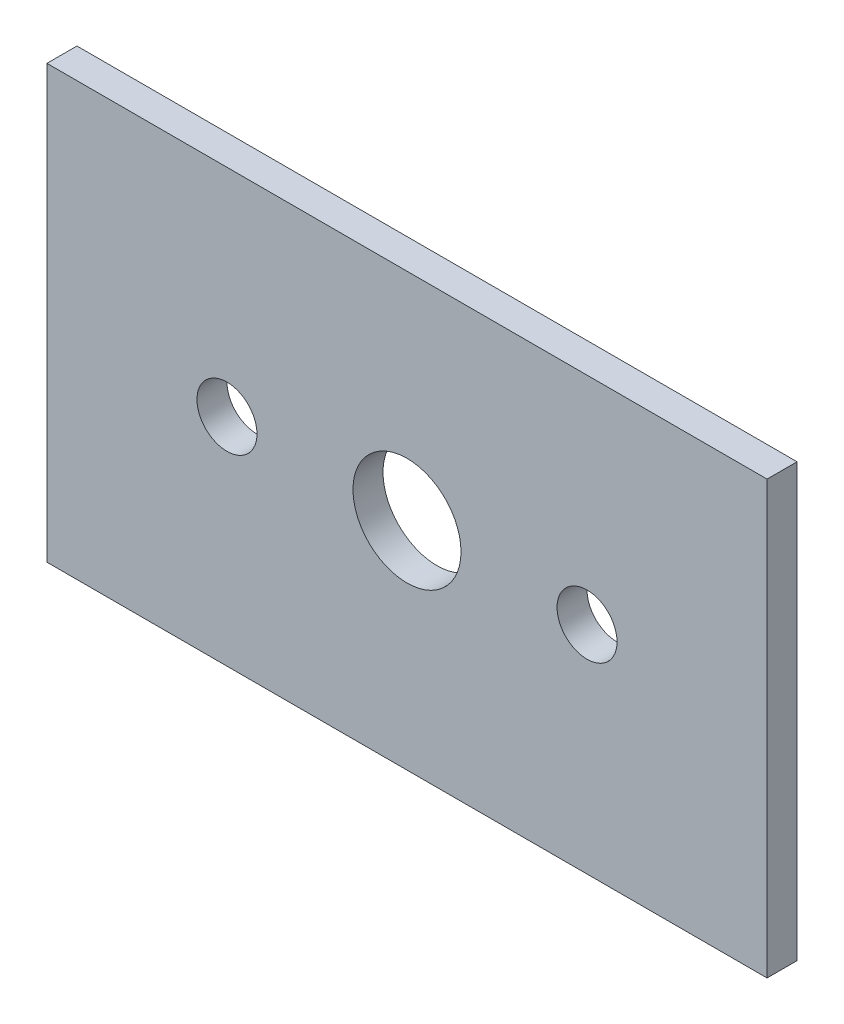
ISO-10303-21;
HEADER;
FILE_DESCRIPTION(('STEP AP214'),'2;1');
FILE_NAME('part.step','',(''),(''),'','','');
FILE_SCHEMA(('AUTOMOTIVE_DESIGN { 1 0 10303 214 1 1 1 1 }'));
ENDSEC;
DATA;
#1=APPLICATION_CONTEXT('core data for automotive mechanical design processes');
#2=APPLICATION_PROTOCOL_DEFINITION('international standard','automotive_design',2000,#1);
#3=PRODUCT_CONTEXT('',#1,'mechanical');
#4=PRODUCT('Part','Part','',(#3));
#5=PRODUCT_RELATED_PRODUCT_CATEGORY('part','',(#4));
#6=PRODUCT_DEFINITION_FORMATION('','',#4);
#7=PRODUCT_DEFINITION_CONTEXT('part definition',#1,'design');
#8=PRODUCT_DEFINITION('design','',#6,#7);
#9=PRODUCT_DEFINITION_SHAPE('','',#8);
#10=(LENGTH_UNIT() NAMED_UNIT(*) SI_UNIT(.MILLI.,.METRE.));
#11=(NAMED_UNIT(*) PLANE_ANGLE_UNIT() SI_UNIT($,.RADIAN.));
#12=(NAMED_UNIT(*) SI_UNIT($,.STERADIAN.) SOLID_ANGLE_UNIT());
#13=UNCERTAINTY_MEASURE_WITH_UNIT(LENGTH_MEASURE(1.E-05),#10,'distance_accuracy_value','');
#14=(GEOMETRIC_REPRESENTATION_CONTEXT(3) GLOBAL_UNCERTAINTY_ASSIGNED_CONTEXT((#13)) GLOBAL_UNIT_ASSIGNED_CONTEXT((#10,
#11,#12)) REPRESENTATION_CONTEXT('',''));
#15=CARTESIAN_POINT('',(0.,0.,0.));
#16=DIRECTION('',(0.,0.,1.));
#17=DIRECTION('',(1.,0.,0.));
#18=AXIS2_PLACEMENT_3D('',#15,#16,#17);
#19=CARTESIAN_POINT('',(0.,0.,6.35));
#20=DIRECTION('',(-1.,0.,0.));
#21=DIRECTION('',(0.,0.,1.));
#22=AXIS2_PLACEMENT_3D('',#19,#20,#21);
#23=PLANE('',#22);
#24=DIRECTION('',(0.,1.,0.));
#25=VECTOR('',#24,1.);
#26=CARTESIAN_POINT('',(0.,0.,0.));
#27=LINE('',#26,#25);
#28=CARTESIAN_POINT('',(0.,0.,0.));
#29=VERTEX_POINT('',#28);
#30=CARTESIAN_POINT('',(0.,91.44,0.));
#31=VERTEX_POINT('',#30);
#32=EDGE_CURVE('E101',#29,#31,#27,.T.);
#33=ORIENTED_EDGE('',*,*,#32,.F.);
#34=DIRECTION('',(0.,0.,-1.));
#35=VECTOR('',#34,1.);
#36=CARTESIAN_POINT('',(0.,0.,6.35));
#37=LINE('',#36,#35);
#38=CARTESIAN_POINT('',(0.,0.,6.35));
#39=VERTEX_POINT('',#38);
#40=EDGE_CURVE('E11',#39,#29,#37,.T.);
#41=ORIENTED_EDGE('',*,*,#40,.F.);
#42=DIRECTION('',(0.,1.,0.));
#43=VECTOR('',#42,1.);
#44=CARTESIAN_POINT('',(0.,0.,6.35));
#45=LINE('',#44,#43);
#46=CARTESIAN_POINT('',(0.,91.44,6.35));
#47=VERTEX_POINT('',#46);
#48=EDGE_CURVE('E95',#39,#47,#45,.T.);
#49=ORIENTED_EDGE('',*,*,#48,.T.);
#50=DIRECTION('',(0.,0.,-1.));
#51=VECTOR('',#50,1.);
#52=CARTESIAN_POINT('',(0.,91.44,6.35));
#53=LINE('',#52,#51);
#54=EDGE_CURVE('E38',#47,#31,#53,.T.);
#55=ORIENTED_EDGE('',*,*,#54,.T.);
#56=EDGE_LOOP('',(#33,#41,#49,#55));
#57=FACE_BOUND('',#56,.T.);
#58=ADVANCED_FACE('F35',(#57),#23,.T.);
#59=CARTESIAN_POINT('',(0.,0.,6.35));
#60=DIRECTION('',(0.,1.,0.));
#61=DIRECTION('',(0.,0.,1.));
#62=AXIS2_PLACEMENT_3D('',#59,#60,#61);
#63=PLANE('',#62);
#64=DIRECTION('',(1.,0.,0.));
#65=VECTOR('',#64,1.);
#66=CARTESIAN_POINT('',(0.,0.,0.));
#67=LINE('',#66,#65);
#68=CARTESIAN_POINT('',(152.4,0.,0.));
#69=VERTEX_POINT('',#68);
#70=EDGE_CURVE('E68',#29,#69,#67,.T.);
#71=ORIENTED_EDGE('',*,*,#70,.T.);
#72=DIRECTION('',(0.,0.,-1.));
#73=VECTOR('',#72,1.);
#74=CARTESIAN_POINT('',(152.4,0.,6.35));
#75=LINE('',#74,#73);
#76=CARTESIAN_POINT('',(152.4,0.,6.35));
#77=VERTEX_POINT('',#76);
#78=EDGE_CURVE('E44',#77,#69,#75,.T.);
#79=ORIENTED_EDGE('',*,*,#78,.F.);
#80=DIRECTION('',(1.,0.,0.));
#81=VECTOR('',#80,1.);
#82=CARTESIAN_POINT('',(0.,0.,6.35));
#83=LINE('',#82,#81);
#84=EDGE_CURVE('E85',#39,#77,#83,.T.);
#85=ORIENTED_EDGE('',*,*,#84,.F.);
#86=ORIENTED_EDGE('',*,*,#40,.T.);
#87=EDGE_LOOP('',(#71,#79,#85,#86));
#88=FACE_BOUND('',#87,.T.);
#89=ADVANCED_FACE('F112',(#88),#63,.F.);
#90=CARTESIAN_POINT('',(152.4,0.,6.35));
#91=DIRECTION('',(-1.,0.,0.));
#92=DIRECTION('',(0.,0.,1.));
#93=AXIS2_PLACEMENT_3D('',#90,#91,#92);
#94=PLANE('',#93);
#95=DIRECTION('',(0.,1.,0.));
#96=VECTOR('',#95,1.);
#97=CARTESIAN_POINT('',(152.4,0.,0.));
#98=LINE('',#97,#96);
#99=CARTESIAN_POINT('',(152.4,91.44,0.));
#100=VERTEX_POINT('',#99);
#101=EDGE_CURVE('E92',#69,#100,#98,.T.);
#102=ORIENTED_EDGE('',*,*,#101,.T.);
#103=DIRECTION('',(0.,0.,-1.));
#104=VECTOR('',#103,1.);
#105=CARTESIAN_POINT('',(152.4,91.44,6.35));
#106=LINE('',#105,#104);
#107=CARTESIAN_POINT('',(152.4,91.44,6.35));
#108=VERTEX_POINT('',#107);
#109=EDGE_CURVE('E89',#108,#100,#106,.T.);
#110=ORIENTED_EDGE('',*,*,#109,.F.);
#111=DIRECTION('',(0.,1.,0.));
#112=VECTOR('',#111,1.);
#113=CARTESIAN_POINT('',(152.4,0.,6.35));
#114=LINE('',#113,#112);
#115=EDGE_CURVE('E80',#77,#108,#114,.T.);
#116=ORIENTED_EDGE('',*,*,#115,.F.);
#117=ORIENTED_EDGE('',*,*,#78,.T.);
#118=EDGE_LOOP('',(#102,#110,#116,#117));
#119=FACE_BOUND('',#118,.T.);
#120=ADVANCED_FACE('F90',(#119),#94,.F.);
#121=CARTESIAN_POINT('',(0.,91.44,6.35));
#122=DIRECTION('',(0.,1.,0.));
#123=DIRECTION('',(0.,0.,1.));
#124=AXIS2_PLACEMENT_3D('',#121,#122,#123);
#125=PLANE('',#124);
#126=DIRECTION('',(1.,0.,0.));
#127=VECTOR('',#126,1.);
#128=CARTESIAN_POINT('',(0.,91.44,0.));
#129=LINE('',#128,#127);
#130=EDGE_CURVE('E104',#31,#100,#129,.T.);
#131=ORIENTED_EDGE('',*,*,#130,.F.);
#132=ORIENTED_EDGE('',*,*,#54,.F.);
#133=DIRECTION('',(1.,0.,0.));
#134=VECTOR('',#133,1.);
#135=CARTESIAN_POINT('',(0.,91.44,6.35));
#136=LINE('',#135,#134);
#137=EDGE_CURVE('E84',#47,#108,#136,.T.);
#138=ORIENTED_EDGE('',*,*,#137,.T.);
#139=ORIENTED_EDGE('',*,*,#109,.T.);
#140=EDGE_LOOP('',(#131,#132,#138,#139));
#141=FACE_BOUND('',#140,.T.);
#142=ADVANCED_FACE('F94',(#141),#125,.T.);
#143=CARTESIAN_POINT('',(0.,0.,6.35));
#144=DIRECTION('',(0.,0.,-1.));
#145=DIRECTION('',(-1.,0.,0.));
#146=AXIS2_PLACEMENT_3D('',#143,#144,#145);
#147=PLANE('',#146);
#148=CARTESIAN_POINT('',(38.1,45.72,6.35));
#149=DIRECTION('',(0.,0.,1.));
#150=DIRECTION('',(1.,0.,0.));
#151=AXIS2_PLACEMENT_3D('',#148,#149,#150);
#152=CIRCLE('',#151,6.35);
#153=CARTESIAN_POINT('',(44.45,45.72,6.35));
#154=VERTEX_POINT('',#153);
#155=EDGE_CURVE('E160',#154,#154,#152,.T.);
#156=ORIENTED_EDGE('',*,*,#155,.F.);
#157=EDGE_LOOP('',(#156));
#158=FACE_BOUND('',#157,.T.);
#159=CARTESIAN_POINT('',(114.3,45.72,6.35));
#160=DIRECTION('',(0.,0.,1.));
#161=DIRECTION('',(1.,0.,0.));
#162=AXIS2_PLACEMENT_3D('',#159,#160,#161);
#163=CIRCLE('',#162,6.35000000000001);
#164=CARTESIAN_POINT('',(120.65,45.72,6.35));
#165=VERTEX_POINT('',#164);
#166=EDGE_CURVE('E154',#165,#165,#163,.T.);
#167=ORIENTED_EDGE('',*,*,#166,.F.);
#168=EDGE_LOOP('',(#167));
#169=FACE_BOUND('',#168,.T.);
#170=CARTESIAN_POINT('',(76.2,45.72,6.35));
#171=DIRECTION('',(0.,0.,1.));
#172=DIRECTION('',(1.,0.,0.));
#173=AXIS2_PLACEMENT_3D('',#170,#171,#172);
#174=CIRCLE('',#173,11.43);
#175=CARTESIAN_POINT('',(87.63,45.72,6.35));
#176=VERTEX_POINT('',#175);
#177=EDGE_CURVE('E157',#176,#176,#174,.T.);
#178=ORIENTED_EDGE('',*,*,#177,.F.);
#179=EDGE_LOOP('',(#178));
#180=FACE_BOUND('',#179,.T.);
#181=ORIENTED_EDGE('',*,*,#48,.F.);
#182=ORIENTED_EDGE('',*,*,#84,.T.);
#183=ORIENTED_EDGE('',*,*,#115,.T.);
#184=ORIENTED_EDGE('',*,*,#137,.F.);
#185=EDGE_LOOP('',(#181,#182,#183,#184));
#186=FACE_BOUND('',#185,.T.);
#187=ADVANCED_FACE('F83',(#158,#169,#180,#186),#147,.F.);
#188=CARTESIAN_POINT('',(0.,0.,0.));
#189=DIRECTION('',(0.,0.,-1.));
#190=DIRECTION('',(-1.,0.,0.));
#191=AXIS2_PLACEMENT_3D('',#188,#189,#190);
#192=PLANE('',#191);
#193=CARTESIAN_POINT('',(38.1,45.72,0.));
#194=DIRECTION('',(0.,0.,1.));
#195=DIRECTION('',(1.,0.,0.));
#196=AXIS2_PLACEMENT_3D('',#193,#194,#195);
#197=CIRCLE('',#196,6.35);
#198=CARTESIAN_POINT('',(44.45,45.72,0.));
#199=VERTEX_POINT('',#198);
#200=EDGE_CURVE('E155',#199,#199,#197,.T.);
#201=ORIENTED_EDGE('',*,*,#200,.T.);
#202=EDGE_LOOP('',(#201));
#203=FACE_BOUND('',#202,.T.);
#204=CARTESIAN_POINT('',(114.3,45.72,0.));
#205=DIRECTION('',(0.,0.,1.));
#206=DIRECTION('',(1.,0.,0.));
#207=AXIS2_PLACEMENT_3D('',#204,#205,#206);
#208=CIRCLE('',#207,6.35000000000001);
#209=CARTESIAN_POINT('',(120.65,45.72,0.));
#210=VERTEX_POINT('',#209);
#211=EDGE_CURVE('E151',#210,#210,#208,.T.);
#212=ORIENTED_EDGE('',*,*,#211,.T.);
#213=EDGE_LOOP('',(#212));
#214=FACE_BOUND('',#213,.T.);
#215=CARTESIAN_POINT('',(76.2,45.72,0.));
#216=DIRECTION('',(0.,0.,1.));
#217=DIRECTION('',(1.,0.,0.));
#218=AXIS2_PLACEMENT_3D('',#215,#216,#217);
#219=CIRCLE('',#218,11.43);
#220=CARTESIAN_POINT('',(87.63,45.72,0.));
#221=VERTEX_POINT('',#220);
#222=EDGE_CURVE('E105',#221,#221,#219,.T.);
#223=ORIENTED_EDGE('',*,*,#222,.T.);
#224=EDGE_LOOP('',(#223));
#225=FACE_BOUND('',#224,.T.);
#226=ORIENTED_EDGE('',*,*,#32,.T.);
#227=ORIENTED_EDGE('',*,*,#130,.T.);
#228=ORIENTED_EDGE('',*,*,#101,.F.);
#229=ORIENTED_EDGE('',*,*,#70,.F.);
#230=EDGE_LOOP('',(#226,#227,#228,#229));
#231=FACE_BOUND('',#230,.T.);
#232=ADVANCED_FACE('F110',(#203,#214,#225,#231),#192,.T.);
#233=CARTESIAN_POINT('',(76.2,45.72,0.));
#234=DIRECTION('',(0.,0.,1.));
#235=DIRECTION('',(1.,0.,0.));
#236=AXIS2_PLACEMENT_3D('',#233,#234,#235);
#237=CYLINDRICAL_SURFACE('',#236,11.43);
#238=ORIENTED_EDGE('',*,*,#222,.F.);
#239=EDGE_LOOP('',(#238));
#240=FACE_BOUND('',#239,.T.);
#241=ORIENTED_EDGE('',*,*,#177,.T.);
#242=EDGE_LOOP('',(#241));
#243=FACE_BOUND('',#242,.T.);
#244=ADVANCED_FACE('F131',(#240,#243),#237,.F.);
#245=CARTESIAN_POINT('',(114.3,45.72,0.));
#246=DIRECTION('',(0.,0.,1.));
#247=DIRECTION('',(1.,0.,0.));
#248=AXIS2_PLACEMENT_3D('',#245,#246,#247);
#249=CYLINDRICAL_SURFACE('',#248,6.35000000000001);
#250=ORIENTED_EDGE('',*,*,#211,.F.);
#251=EDGE_LOOP('',(#250));
#252=FACE_BOUND('',#251,.T.);
#253=ORIENTED_EDGE('',*,*,#166,.T.);
#254=EDGE_LOOP('',(#253));
#255=FACE_BOUND('',#254,.T.);
#256=ADVANCED_FACE('F138',(#252,#255),#249,.F.);
#257=CARTESIAN_POINT('',(38.1,45.72,0.));
#258=DIRECTION('',(0.,0.,1.));
#259=DIRECTION('',(1.,0.,0.));
#260=AXIS2_PLACEMENT_3D('',#257,#258,#259);
#261=CYLINDRICAL_SURFACE('',#260,6.35);
#262=ORIENTED_EDGE('',*,*,#200,.F.);
#263=EDGE_LOOP('',(#262));
#264=FACE_BOUND('',#263,.T.);
#265=ORIENTED_EDGE('',*,*,#155,.T.);
#266=EDGE_LOOP('',(#265));
#267=FACE_BOUND('',#266,.T.);
#268=ADVANCED_FACE('F140',(#264,#267),#261,.F.);
#269=CLOSED_SHELL('',(#58,#89,#120,#142,#187,#232,#244,#256,#268));
#270=MANIFOLD_SOLID_BREP('B2',#269);
#271=ADVANCED_BREP_SHAPE_REPRESENTATION('',(#18,#270),#14);
#272=SHAPE_DEFINITION_REPRESENTATION(#9,#271);
ENDSEC;
END-ISO-10303-21;
